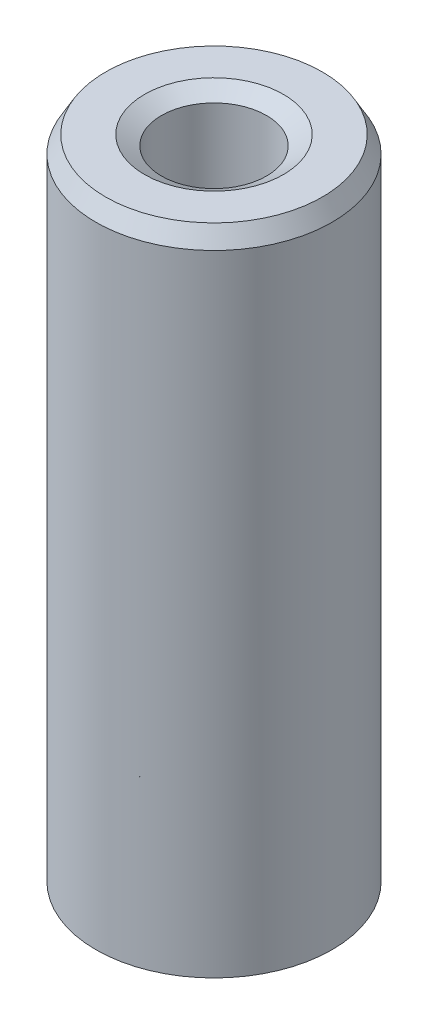
ISO-10303-21;
HEADER;
FILE_DESCRIPTION(('STEP AP214'),'2;1');
FILE_NAME('part.step','',(''),(''),'','','');
FILE_SCHEMA(('AUTOMOTIVE_DESIGN { 1 0 10303 214 1 1 1 1 }'));
ENDSEC;
DATA;
#1=APPLICATION_CONTEXT('core data for automotive mechanical design processes');
#2=APPLICATION_PROTOCOL_DEFINITION('international standard','automotive_design',2000,#1);
#3=PRODUCT_CONTEXT('',#1,'mechanical');
#4=PRODUCT('Part','Part','',(#3));
#5=PRODUCT_RELATED_PRODUCT_CATEGORY('part','',(#4));
#6=PRODUCT_DEFINITION_FORMATION('','',#4);
#7=PRODUCT_DEFINITION_CONTEXT('part definition',#1,'design');
#8=PRODUCT_DEFINITION('design','',#6,#7);
#9=PRODUCT_DEFINITION_SHAPE('','',#8);
#10=(LENGTH_UNIT() NAMED_UNIT(*) SI_UNIT(.MILLI.,.METRE.));
#11=(NAMED_UNIT(*) PLANE_ANGLE_UNIT() SI_UNIT($,.RADIAN.));
#12=(NAMED_UNIT(*) SI_UNIT($,.STERADIAN.) SOLID_ANGLE_UNIT());
#13=UNCERTAINTY_MEASURE_WITH_UNIT(LENGTH_MEASURE(1.E-05),#10,'distance_accuracy_value','');
#14=(GEOMETRIC_REPRESENTATION_CONTEXT(3) GLOBAL_UNCERTAINTY_ASSIGNED_CONTEXT((#13)) GLOBAL_UNIT_ASSIGNED_CONTEXT((#10,
#11,#12)) REPRESENTATION_CONTEXT('',''));
#15=CARTESIAN_POINT('',(0.,0.,0.));
#16=DIRECTION('',(0.,0.,1.));
#17=DIRECTION('',(1.,0.,0.));
#18=AXIS2_PLACEMENT_3D('',#15,#16,#17);
#19=CARTESIAN_POINT('',(0.,97.2664174234266,0.));
#20=DIRECTION('',(0.,-1.,0.));
#21=DIRECTION('',(0.,0.,-1.));
#22=AXIS2_PLACEMENT_3D('',#19,#20,#21);
#23=CYLINDRICAL_SURFACE('',#22,17.5);
#24=CARTESIAN_POINT('',(0.,1.45047802636993,0.));
#25=DIRECTION('',(0.,1.,0.));
#26=DIRECTION('',(0.,0.,1.));
#27=AXIS2_PLACEMENT_3D('',#24,#25,#26);
#28=CIRCLE('',#27,17.5);
#29=CARTESIAN_POINT('',(0.,1.45047802636993,-17.5));
#30=VERTEX_POINT('',#29);
#31=EDGE_CURVE('E10',#30,#30,#28,.T.);
#32=CARTESIAN_POINT('',(0.,94.7541157864918,0.));
#33=DIRECTION('',(0.,1.,0.));
#34=DIRECTION('',(0.,0.,1.));
#35=AXIS2_PLACEMENT_3D('',#32,#33,#34);
#36=CIRCLE('',#35,17.5);
#37=CARTESIAN_POINT('',(0.,94.7541157864918,-17.5));
#38=VERTEX_POINT('',#37);
#39=EDGE_CURVE('E50',#38,#38,#36,.F.);
#40=CARTESIAN_POINT('',(0.,1.45047802636993,-17.5));
#41=CARTESIAN_POINT('',(0.,2.42239091970453,-17.5));
#42=CARTESIAN_POINT('',(0.,3.39430381303913,-17.5));
#43=CARTESIAN_POINT('',(0.,5.33812959970834,-17.5));
#44=CARTESIAN_POINT('',(0.,6.31004249304294,-17.5));
#45=CARTESIAN_POINT('',(0.,8.25386827971215,-17.5));
#46=CARTESIAN_POINT('',(0.,9.22578117304675,-17.5));
#47=CARTESIAN_POINT('',(0.,11.169606959716,-17.5));
#48=CARTESIAN_POINT('',(0.,12.1415198530506,-17.5));
#49=CARTESIAN_POINT('',(0.,14.0853456397198,-17.5));
#50=CARTESIAN_POINT('',(0.,15.0572585330544,-17.5));
#51=CARTESIAN_POINT('',(0.,17.0010843197236,-17.5));
#52=CARTESIAN_POINT('',(0.,17.9729972130582,-17.5));
#53=CARTESIAN_POINT('',(0.,19.9168229997274,-17.5));
#54=CARTESIAN_POINT('',(0.,20.888735893062,-17.5));
#55=CARTESIAN_POINT('',(0.,22.8325616797312,-17.5));
#56=CARTESIAN_POINT('',(0.,23.8044745730658,-17.5));
#57=CARTESIAN_POINT('',(0.,25.748300359735,-17.5));
#58=CARTESIAN_POINT('',(0.,26.7202132530696,-17.5));
#59=CARTESIAN_POINT('',(0.,28.6640390397388,-17.5));
#60=CARTESIAN_POINT('',(0.,29.6359519330734,-17.5));
#61=CARTESIAN_POINT('',(0.,31.5797777197426,-17.5));
#62=CARTESIAN_POINT('',(0.,32.5516906130772,-17.5));
#63=CARTESIAN_POINT('',(0.,34.4955163997464,-17.5));
#64=CARTESIAN_POINT('',(0.,35.467429293081,-17.5));
#65=CARTESIAN_POINT('',(0.,37.4112550797502,-17.5));
#66=CARTESIAN_POINT('',(0.,38.3831679730848,-17.5));
#67=CARTESIAN_POINT('',(0.,40.326993759754,-17.5));
#68=CARTESIAN_POINT('',(0.,41.2989066530886,-17.5));
#69=CARTESIAN_POINT('',(0.,43.2427324397578,-17.5));
#70=CARTESIAN_POINT('',(0.,44.2146453330924,-17.5));
#71=CARTESIAN_POINT('',(0.,46.1584711197616,-17.5));
#72=CARTESIAN_POINT('',(0.,47.1303840130962,-17.5));
#73=CARTESIAN_POINT('',(0.,49.0742097997655,-17.5));
#74=CARTESIAN_POINT('',(0.,50.0461226931001,-17.5));
#75=CARTESIAN_POINT('',(0.,51.9899484797693,-17.5));
#76=CARTESIAN_POINT('',(0.,52.9618613731039,-17.5));
#77=CARTESIAN_POINT('',(0.,54.9056871597731,-17.5));
#78=CARTESIAN_POINT('',(0.,55.8776000531077,-17.5));
#79=CARTESIAN_POINT('',(0.,57.8214258397769,-17.5));
#80=CARTESIAN_POINT('',(0.,58.7933387331115,-17.5));
#81=CARTESIAN_POINT('',(0.,60.7371645197807,-17.5));
#82=CARTESIAN_POINT('',(0.,61.7090774131153,-17.5));
#83=CARTESIAN_POINT('',(0.,63.6529031997845,-17.5));
#84=CARTESIAN_POINT('',(0.,64.6248160931191,-17.5));
#85=CARTESIAN_POINT('',(0.,66.5686418797883,-17.5));
#86=CARTESIAN_POINT('',(0.,67.5405547731229,-17.5));
#87=CARTESIAN_POINT('',(0.,69.4843805597921,-17.5));
#88=CARTESIAN_POINT('',(0.,70.4562934531267,-17.5));
#89=CARTESIAN_POINT('',(0.,72.4001192397959,-17.5));
#90=CARTESIAN_POINT('',(0.,73.3720321331305,-17.5));
#91=CARTESIAN_POINT('',(0.,75.3158579197997,-17.5));
#92=CARTESIAN_POINT('',(0.,76.2877708131343,-17.5));
#93=CARTESIAN_POINT('',(0.,78.2315965998035,-17.5));
#94=CARTESIAN_POINT('',(0.,79.2035094931381,-17.5));
#95=CARTESIAN_POINT('',(0.,81.1473352798074,-17.5));
#96=CARTESIAN_POINT('',(0.,82.1192481731419,-17.5));
#97=CARTESIAN_POINT('',(0.,84.0630739598111,-17.5));
#98=CARTESIAN_POINT('',(0.,85.0349868531457,-17.5));
#99=CARTESIAN_POINT('',(0.,86.9788126398149,-17.5));
#100=CARTESIAN_POINT('',(0.,87.9507255331496,-17.5));
#101=CARTESIAN_POINT('',(0.,89.8945513198188,-17.5));
#102=CARTESIAN_POINT('',(0.,90.8664642131534,-17.5));
#103=CARTESIAN_POINT('',(0.,92.8102899998226,-17.5));
#104=CARTESIAN_POINT('',(0.,93.7822028931572,-17.5));
#105=CARTESIAN_POINT('',(0.,94.7541157864918,-17.5));
#106=B_SPLINE_CURVE_WITH_KNOTS('',3,(#40,#41,#42,#43,#44,#45,#46,#47,#48,#49,#50,#51,#52,#53,
#54,#55,#56,#57,#58,#59,#60,#61,#62,#63,#64,#65,#66,#67,#68,#69,#70,#71,#72,#73,#74,#75,#76,#77,
#78,#79,#80,#81,#82,#83,#84,#85,#86,#87,#88,#89,#90,#91,#92,#93,#94,#95,#96,#97,#98,#99,#100,
#101,#102,#103,#104,#105),.UNSPECIFIED.,.F.,.F.,(4,2,2,2,2,2,2,2,2,2,2,2,2,2,2,2,2,2,2,2,2,2,2,
2,2,2,2,2,2,2,2,2,4),(0.,2.9157386800038,5.83147736000762,8.74721604001143,11.6629547200152,
14.578693400019,17.4944320800229,20.4101707600267,23.3259094400305,26.2416481200343,
29.1573868000381,32.0731254800419,34.9888641600457,37.9046028400495,40.8203415200533,
43.7360802000571,46.6518188800609,49.5675575600647,52.4832962400685,55.3990349200724,
58.3147736000762,61.23051228008,64.1462509600838,67.0619896400876,69.9777283200914,
72.8934670000952,75.809205680099,78.7249443601028,81.6406830401066,84.5564217201104,
87.4721604001142,90.387899080118,93.3036377601218),.UNSPECIFIED.);
#107=EDGE_CURVE('BSEAM39',#30,#38,#106,.T.);
#108=ORIENTED_EDGE('',*,*,#31,.T.);
#109=ORIENTED_EDGE('',*,*,#39,.T.);
#110=ORIENTED_EDGE('',*,*,#107,.T.);
#111=ORIENTED_EDGE('',*,*,#107,.F.);
#112=EDGE_LOOP('',(#108,#110,#109,#111));
#113=FACE_BOUND('',#112,.T.);
#114=ADVANCED_FACE('F39',(#113),#23,.T.);
#115=CARTESIAN_POINT('',(0.,97.2664174234266,0.));
#116=DIRECTION('',(0.,1.,0.));
#117=DIRECTION('',(0.,0.,1.));
#118=AXIS2_PLACEMENT_3D('',#115,#116,#117);
#119=PLANE('',#118);
#120=CARTESIAN_POINT('',(0.,97.2664174234266,0.));
#121=DIRECTION('',(0.,1.,0.));
#122=DIRECTION('',(0.,0.,1.));
#123=AXIS2_PLACEMENT_3D('',#120,#121,#122);
#124=CIRCLE('',#123,10.2905281328665);
#125=CARTESIAN_POINT('',(0.,97.2664174234266,10.2905281328665));
#126=VERTEX_POINT('',#125);
#127=EDGE_CURVE('E58',#126,#126,#124,.F.);
#128=ORIENTED_EDGE('',*,*,#127,.T.);
#129=EDGE_LOOP('',(#128));
#130=FACE_BOUND('',#129,.T.);
#131=CARTESIAN_POINT('',(0.,97.2664174234266,0.));
#132=DIRECTION('',(0.,1.,0.));
#133=DIRECTION('',(0.,0.,1.));
#134=AXIS2_PLACEMENT_3D('',#131,#132,#133);
#135=CIRCLE('',#134,16.0495219736301);
#136=CARTESIAN_POINT('',(0.,97.2664174234266,16.0495219736301));
#137=VERTEX_POINT('',#136);
#138=EDGE_CURVE('E61',#137,#137,#135,.T.);
#139=ORIENTED_EDGE('',*,*,#138,.T.);
#140=EDGE_LOOP('',(#139));
#141=FACE_BOUND('',#140,.T.);
#142=ADVANCED_FACE('F88',(#130,#141),#119,.T.);
#143=CARTESIAN_POINT('',(0.,0.,0.));
#144=DIRECTION('',(0.,1.,0.));
#145=DIRECTION('',(0.,0.,1.));
#146=AXIS2_PLACEMENT_3D('',#143,#144,#145);
#147=PLANE('',#146);
#148=CARTESIAN_POINT('',(0.,0.,0.));
#149=DIRECTION('',(0.,1.,0.));
#150=DIRECTION('',(0.,0.,1.));
#151=AXIS2_PLACEMENT_3D('',#148,#149,#150);
#152=CIRCLE('',#151,9.22870452230149);
#153=CARTESIAN_POINT('',(0.,0.,9.22870452230149));
#154=VERTEX_POINT('',#153);
#155=EDGE_CURVE('E51',#154,#154,#152,.T.);
#156=ORIENTED_EDGE('',*,*,#155,.T.);
#157=EDGE_LOOP('',(#156));
#158=FACE_BOUND('',#157,.T.);
#159=CARTESIAN_POINT('',(0.,0.,0.));
#160=DIRECTION('',(0.,1.,0.));
#161=DIRECTION('',(0.,0.,1.));
#162=AXIS2_PLACEMENT_3D('',#159,#160,#161);
#163=CIRCLE('',#162,14.9876983630651);
#164=CARTESIAN_POINT('',(0.,0.,14.9876983630651));
#165=VERTEX_POINT('',#164);
#166=EDGE_CURVE('E54',#165,#165,#163,.F.);
#167=ORIENTED_EDGE('',*,*,#166,.T.);
#168=EDGE_LOOP('',(#167));
#169=FACE_BOUND('',#168,.T.);
#170=ADVANCED_FACE('F83',(#158,#169),#147,.F.);
#171=CARTESIAN_POINT('',(0.,97.2664174234266,0.));
#172=DIRECTION('',(0.,-1.,0.));
#173=DIRECTION('',(0.,0.,-1.));
#174=AXIS2_PLACEMENT_3D('',#171,#172,#173);
#175=CYLINDRICAL_SURFACE('',#174,7.7782264959316);
#176=CARTESIAN_POINT('',(0.,95.8159393970567,0.));
#177=DIRECTION('',(0.,1.,0.));
#178=DIRECTION('',(0.,0.,1.));
#179=AXIS2_PLACEMENT_3D('',#176,#177,#178);
#180=CIRCLE('',#179,7.7782264959316);
#181=CARTESIAN_POINT('',(0.,95.8159393970567,-7.7782264959316));
#182=VERTEX_POINT('',#181);
#183=EDGE_CURVE('E67',#182,#182,#180,.T.);
#184=CARTESIAN_POINT('',(0.,2.51230163693492,0.));
#185=DIRECTION('',(0.,1.,0.));
#186=DIRECTION('',(0.,0.,1.));
#187=AXIS2_PLACEMENT_3D('',#184,#185,#186);
#188=CIRCLE('',#187,7.7782264959316);
#189=CARTESIAN_POINT('',(0.,2.5123016369349,-7.7782264959316));
#190=VERTEX_POINT('',#189);
#191=EDGE_CURVE('E69',#190,#190,#188,.F.);
#192=CARTESIAN_POINT('',(0.,95.8159393970567,-7.7782264959316));
#193=CARTESIAN_POINT('',(0.,94.8440265037221,-7.7782264959316));
#194=CARTESIAN_POINT('',(0.,93.8721136103875,-7.7782264959316));
#195=CARTESIAN_POINT('',(0.,91.9282878237183,-7.7782264959316));
#196=CARTESIAN_POINT('',(0.,90.9563749303837,-7.7782264959316));
#197=CARTESIAN_POINT('',(0.,89.0125491437145,-7.7782264959316));
#198=CARTESIAN_POINT('',(0.,88.0406362503799,-7.7782264959316));
#199=CARTESIAN_POINT('',(0.,86.0968104637107,-7.7782264959316));
#200=CARTESIAN_POINT('',(0.,85.1248975703761,-7.7782264959316));
#201=CARTESIAN_POINT('',(0.,83.1810717837069,-7.7782264959316));
#202=CARTESIAN_POINT('',(0.,82.2091588903723,-7.7782264959316));
#203=CARTESIAN_POINT('',(0.,80.2653331037031,-7.7782264959316));
#204=CARTESIAN_POINT('',(0.,79.2934202103685,-7.7782264959316));
#205=CARTESIAN_POINT('',(0.,77.3495944236993,-7.7782264959316));
#206=CARTESIAN_POINT('',(0.,76.3776815303647,-7.7782264959316));
#207=CARTESIAN_POINT('',(0.,74.4338557436955,-7.7782264959316));
#208=CARTESIAN_POINT('',(0.,73.4619428503609,-7.7782264959316));
#209=CARTESIAN_POINT('',(0.,71.5181170636917,-7.7782264959316));
#210=CARTESIAN_POINT('',(0.,70.5462041703571,-7.7782264959316));
#211=CARTESIAN_POINT('',(0.,68.6023783836879,-7.7782264959316));
#212=CARTESIAN_POINT('',(0.,67.6304654903533,-7.7782264959316));
#213=CARTESIAN_POINT('',(0.,65.6866397036841,-7.7782264959316));
#214=CARTESIAN_POINT('',(0.,64.7147268103495,-7.7782264959316));
#215=CARTESIAN_POINT('',(0.,62.7709010236803,-7.7782264959316));
#216=CARTESIAN_POINT('',(0.,61.7989881303457,-7.7782264959316));
#217=CARTESIAN_POINT('',(0.,59.8551623436764,-7.7782264959316));
#218=CARTESIAN_POINT('',(0.,58.8832494503418,-7.7782264959316));
#219=CARTESIAN_POINT('',(0.,56.9394236636726,-7.7782264959316));
#220=CARTESIAN_POINT('',(0.,55.967510770338,-7.7782264959316));
#221=CARTESIAN_POINT('',(0.,54.0236849836688,-7.7782264959316));
#222=CARTESIAN_POINT('',(0.,53.0517720903342,-7.7782264959316));
#223=CARTESIAN_POINT('',(0.,51.107946303665,-7.7782264959316));
#224=CARTESIAN_POINT('',(0.,50.1360334103304,-7.7782264959316));
#225=CARTESIAN_POINT('',(0.,48.1922076236612,-7.7782264959316));
#226=CARTESIAN_POINT('',(0.,47.2202947303266,-7.7782264959316));
#227=CARTESIAN_POINT('',(0.,45.2764689436574,-7.7782264959316));
#228=CARTESIAN_POINT('',(0.,44.3045560503228,-7.7782264959316));
#229=CARTESIAN_POINT('',(0.,42.3607302636536,-7.7782264959316));
#230=CARTESIAN_POINT('',(0.,41.388817370319,-7.7782264959316));
#231=CARTESIAN_POINT('',(0.,39.4449915836498,-7.7782264959316));
#232=CARTESIAN_POINT('',(0.,38.4730786903152,-7.7782264959316));
#233=CARTESIAN_POINT('',(0.,36.529252903646,-7.7782264959316));
#234=CARTESIAN_POINT('',(0.,35.5573400103114,-7.7782264959316));
#235=CARTESIAN_POINT('',(0.,33.6135142236422,-7.7782264959316));
#236=CARTESIAN_POINT('',(0.,32.6416013303076,-7.7782264959316));
#237=CARTESIAN_POINT('',(0.,30.6977755436384,-7.7782264959316));
#238=CARTESIAN_POINT('',(0.,29.7258626503038,-7.7782264959316));
#239=CARTESIAN_POINT('',(0.,27.7820368636346,-7.7782264959316));
#240=CARTESIAN_POINT('',(0.,26.8101239703,-7.7782264959316));
#241=CARTESIAN_POINT('',(0.,24.8662981836308,-7.7782264959316));
#242=CARTESIAN_POINT('',(0.,23.8943852902962,-7.7782264959316));
#243=CARTESIAN_POINT('',(0.,21.950559503627,-7.7782264959316));
#244=CARTESIAN_POINT('',(0.,20.9786466102923,-7.7782264959316));
#245=CARTESIAN_POINT('',(0.,19.0348208236231,-7.7782264959316));
#246=CARTESIAN_POINT('',(0.,18.0629079302885,-7.7782264959316));
#247=CARTESIAN_POINT('',(0.,16.1190821436193,-7.7782264959316));
#248=CARTESIAN_POINT('',(0.,15.1471692502847,-7.7782264959316));
#249=CARTESIAN_POINT('',(0.,13.2033434636155,-7.7782264959316));
#250=CARTESIAN_POINT('',(0.,12.2314305702809,-7.7782264959316));
#251=CARTESIAN_POINT('',(0.,10.2876047836117,-7.7782264959316));
#252=CARTESIAN_POINT('',(0.,9.31569189027712,-7.7782264959316));
#253=CARTESIAN_POINT('',(0.,7.37186610360791,-7.7782264959316));
#254=CARTESIAN_POINT('',(0.,6.39995321027331,-7.7782264959316));
#255=CARTESIAN_POINT('',(0.,4.45612742360411,-7.7782264959316));
#256=CARTESIAN_POINT('',(0.,3.4842145302695,-7.7782264959316));
#257=CARTESIAN_POINT('',(0.,2.5123016369349,-7.7782264959316));
#258=B_SPLINE_CURVE_WITH_KNOTS('',3,(#192,#193,#194,#195,#196,#197,#198,#199,#200,#201,#202,
#203,#204,#205,#206,#207,#208,#209,#210,#211,#212,#213,#214,#215,#216,#217,#218,#219,#220,#221,
#222,#223,#224,#225,#226,#227,#228,#229,#230,#231,#232,#233,#234,#235,#236,#237,#238,#239,#240,
#241,#242,#243,#244,#245,#246,#247,#248,#249,#250,#251,#252,#253,#254,#255,#256,#257),
.UNSPECIFIED.,.F.,.F.,(4,2,2,2,2,2,2,2,2,2,2,2,2,2,2,2,2,2,2,2,2,2,2,2,2,2,2,2,2,2,2,2,4),(0.,
2.9157386800038,5.83147736000761,8.74721604001141,11.6629547200152,14.578693400019,
17.4944320800228,20.4101707600266,23.3259094400304,26.2416481200343,29.1573868000381,
32.0731254800419,34.9888641600457,37.9046028400495,40.8203415200533,43.7360802000571,
46.6518188800609,49.5675575600647,52.4832962400685,55.3990349200723,58.3147736000761,
61.2305122800799,64.1462509600837,67.0619896400876,69.9777283200914,72.8934670000952,
75.809205680099,78.7249443601028,81.6406830401066,84.5564217201104,87.4721604001142,
90.387899080118,93.3036377601218),.UNSPECIFIED.);
#259=EDGE_CURVE('BSEAM71',#182,#190,#258,.T.);
#260=ORIENTED_EDGE('',*,*,#183,.T.);
#261=ORIENTED_EDGE('',*,*,#191,.T.);
#262=ORIENTED_EDGE('',*,*,#259,.T.);
#263=ORIENTED_EDGE('',*,*,#259,.F.);
#264=EDGE_LOOP('',(#260,#262,#261,#263));
#265=FACE_BOUND('',#264,.T.);
#266=ADVANCED_FACE('F71',(#265),#175,.F.);
#267=CARTESIAN_POINT('',(0.,95.8159393970567,0.));
#268=DIRECTION('',(0.,1.,0.));
#269=DIRECTION('',(0.,0.,1.));
#270=AXIS2_PLACEMENT_3D('',#267,#268,#269);
#271=CONICAL_SURFACE('',#270,7.7782264959316,1.0471975511966);
#272=ORIENTED_EDGE('',*,*,#127,.F.);
#273=EDGE_LOOP('',(#272));
#274=FACE_BOUND('',#273,.T.);
#275=ORIENTED_EDGE('',*,*,#183,.F.);
#276=EDGE_LOOP('',(#275));
#277=FACE_BOUND('',#276,.T.);
#278=ADVANCED_FACE('F77',(#274,#277),#271,.F.);
#279=CARTESIAN_POINT('',(0.,0.,0.));
#280=DIRECTION('',(0.,-1.,0.));
#281=DIRECTION('',(0.,0.,-1.));
#282=AXIS2_PLACEMENT_3D('',#279,#280,#281);
#283=CONICAL_SURFACE('',#282,9.22870452230149,0.523598775598292);
#284=ORIENTED_EDGE('',*,*,#191,.F.);
#285=EDGE_LOOP('',(#284));
#286=FACE_BOUND('',#285,.T.);
#287=ORIENTED_EDGE('',*,*,#155,.F.);
#288=EDGE_LOOP('',(#287));
#289=FACE_BOUND('',#288,.T.);
#290=ADVANCED_FACE('F73',(#286,#289),#283,.F.);
#291=CARTESIAN_POINT('',(0.,1.45047802636993,0.));
#292=DIRECTION('',(0.,1.,0.));
#293=DIRECTION('',(0.,0.,1.));
#294=AXIS2_PLACEMENT_3D('',#291,#292,#293);
#295=CONICAL_SURFACE('',#294,17.5,1.0471975511966);
#296=ORIENTED_EDGE('',*,*,#166,.F.);
#297=EDGE_LOOP('',(#296));
#298=FACE_BOUND('',#297,.T.);
#299=ORIENTED_EDGE('',*,*,#31,.F.);
#300=EDGE_LOOP('',(#299));
#301=FACE_BOUND('',#300,.T.);
#302=ADVANCED_FACE('F76',(#298,#301),#295,.T.);
#303=CARTESIAN_POINT('',(0.,97.2664174234266,0.));
#304=DIRECTION('',(0.,-1.,0.));
#305=DIRECTION('',(0.,0.,-1.));
#306=AXIS2_PLACEMENT_3D('',#303,#304,#305);
#307=CONICAL_SURFACE('',#306,16.0495219736301,0.523598775598296);
#308=ORIENTED_EDGE('',*,*,#39,.F.);
#309=EDGE_LOOP('',(#308));
#310=FACE_BOUND('',#309,.T.);
#311=ORIENTED_EDGE('',*,*,#138,.F.);
#312=EDGE_LOOP('',(#311));
#313=FACE_BOUND('',#312,.T.);
#314=ADVANCED_FACE('F45',(#310,#313),#307,.T.);
#315=CLOSED_SHELL('',(#114,#142,#170,#266,#278,#290,#302,#314));
#316=MANIFOLD_SOLID_BREP('B2',#315);
#317=ADVANCED_BREP_SHAPE_REPRESENTATION('',(#18,#316),#14);
#318=SHAPE_DEFINITION_REPRESENTATION(#9,#317);
ENDSEC;
END-ISO-10303-21;
